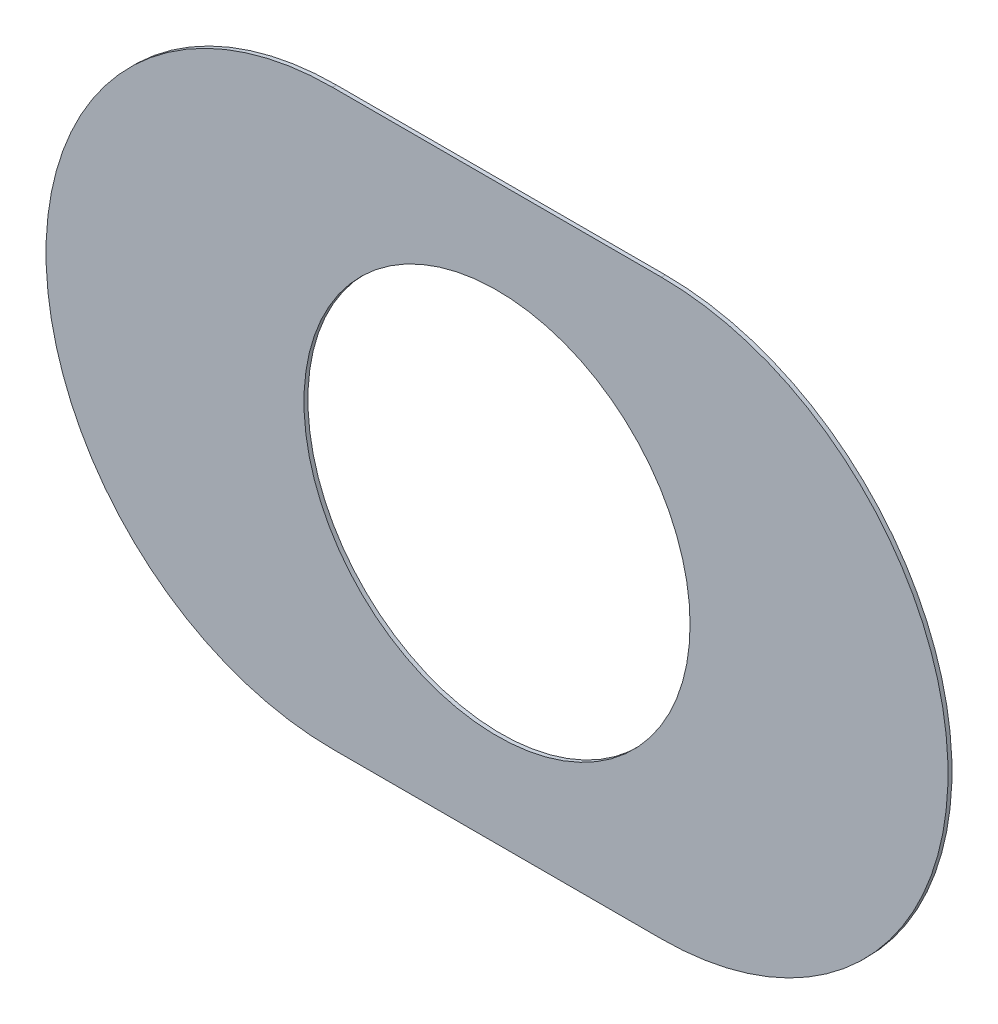
ISO-10303-21;
HEADER;
FILE_DESCRIPTION(('STEP AP214'),'2;1');
FILE_NAME('part.step','',(''),(''),'','','');
FILE_SCHEMA(('AUTOMOTIVE_DESIGN { 1 0 10303 214 1 1 1 1 }'));
ENDSEC;
DATA;
#1=APPLICATION_CONTEXT('core data for automotive mechanical design processes');
#2=APPLICATION_PROTOCOL_DEFINITION('international standard','automotive_design',2000,#1);
#3=PRODUCT_CONTEXT('',#1,'mechanical');
#4=PRODUCT('Part','Part','',(#3));
#5=PRODUCT_RELATED_PRODUCT_CATEGORY('part','',(#4));
#6=PRODUCT_DEFINITION_FORMATION('','',#4);
#7=PRODUCT_DEFINITION_CONTEXT('part definition',#1,'design');
#8=PRODUCT_DEFINITION('design','',#6,#7);
#9=PRODUCT_DEFINITION_SHAPE('','',#8);
#10=(LENGTH_UNIT() NAMED_UNIT(*) SI_UNIT(.MILLI.,.METRE.));
#11=(NAMED_UNIT(*) PLANE_ANGLE_UNIT() SI_UNIT($,.RADIAN.));
#12=(NAMED_UNIT(*) SI_UNIT($,.STERADIAN.) SOLID_ANGLE_UNIT());
#13=UNCERTAINTY_MEASURE_WITH_UNIT(LENGTH_MEASURE(1.E-05),#10,'distance_accuracy_value','');
#14=(GEOMETRIC_REPRESENTATION_CONTEXT(3) GLOBAL_UNCERTAINTY_ASSIGNED_CONTEXT((#13)) GLOBAL_UNIT_ASSIGNED_CONTEXT((#10,
#11,#12)) REPRESENTATION_CONTEXT('',''));
#15=CARTESIAN_POINT('',(0.,0.,0.));
#16=DIRECTION('',(0.,0.,1.));
#17=DIRECTION('',(1.,0.,0.));
#18=AXIS2_PLACEMENT_3D('',#15,#16,#17);
#19=CARTESIAN_POINT('',(24.3000003427268,32.3200006854535,0.));
#20=DIRECTION('',(0.,0.,1.));
#21=DIRECTION('',(1.,0.,0.));
#22=AXIS2_PLACEMENT_3D('',#19,#20,#21);
#23=PLANE('',#22);
#24=CARTESIAN_POINT('',(24.3000003427268,32.3200006854535,0.));
#25=DIRECTION('',(0.,0.,-1.));
#26=DIRECTION('',(-1.,0.,0.));
#27=AXIS2_PLACEMENT_3D('',#24,#25,#26);
#28=CIRCLE('',#27,0.49);
#29=CARTESIAN_POINT('',(24.7900003427268,32.3200006854535,0.));
#30=VERTEX_POINT('',#29);
#31=EDGE_CURVE('E79',#30,#30,#28,.T.);
#32=ORIENTED_EDGE('',*,*,#31,.T.);
#33=EDGE_LOOP('',(#32));
#34=FACE_BOUND('',#33,.T.);
#35=CARTESIAN_POINT('',(23.8825938881802,32.3200006854535,0.));
#36=DIRECTION('',(0.,0.,1.));
#37=DIRECTION('',(0.,1.,0.));
#38=AXIS2_PLACEMENT_3D('',#35,#36,#37);
#39=CIRCLE('',#38,0.727257121659981);
#40=CARTESIAN_POINT('',(23.8825938881802,33.0472578071135,0.));
#41=VERTEX_POINT('',#40);
#42=CARTESIAN_POINT('',(23.8825938881802,31.5927435637935,0.));
#43=VERTEX_POINT('',#42);
#44=EDGE_CURVE('E28',#41,#43,#39,.T.);
#45=ORIENTED_EDGE('',*,*,#44,.T.);
#46=DIRECTION('',(1.,0.,0.));
#47=VECTOR('',#46,1.);
#48=CARTESIAN_POINT('',(23.8825938881802,31.5927435637935,0.));
#49=LINE('',#48,#47);
#50=CARTESIAN_POINT('',(24.7174067972734,31.5927435637935,0.));
#51=VERTEX_POINT('',#50);
#52=EDGE_CURVE('E90',#43,#51,#49,.T.);
#53=ORIENTED_EDGE('',*,*,#52,.T.);
#54=CARTESIAN_POINT('',(24.7174067972734,32.3200006854535,0.));
#55=DIRECTION('',(0.,0.,1.));
#56=DIRECTION('',(0.,-1.,0.));
#57=AXIS2_PLACEMENT_3D('',#54,#55,#56);
#58=CIRCLE('',#57,0.727257121659981);
#59=CARTESIAN_POINT('',(24.7174067972734,33.0472578071135,0.));
#60=VERTEX_POINT('',#59);
#61=EDGE_CURVE('E67',#51,#60,#58,.T.);
#62=ORIENTED_EDGE('',*,*,#61,.T.);
#63=DIRECTION('',(-1.,0.,0.));
#64=VECTOR('',#63,1.);
#65=CARTESIAN_POINT('',(24.7174067972734,33.0472578071135,0.));
#66=LINE('',#65,#64);
#67=EDGE_CURVE('E21',#60,#41,#66,.T.);
#68=ORIENTED_EDGE('',*,*,#67,.T.);
#69=EDGE_LOOP('',(#45,#53,#62,#68));
#70=FACE_BOUND('',#69,.T.);
#71=ADVANCED_FACE('F17',(#34,#70),#23,.T.);
#72=CARTESIAN_POINT('',(24.3000003427268,32.3200006854535,-0.01));
#73=DIRECTION('',(0.,0.,1.));
#74=DIRECTION('',(1.,0.,0.));
#75=AXIS2_PLACEMENT_3D('',#72,#73,#74);
#76=PLANE('',#75);
#77=CARTESIAN_POINT('',(24.3000003427268,32.3200006854535,-0.01));
#78=DIRECTION('',(0.,0.,-1.));
#79=DIRECTION('',(-1.,0.,0.));
#80=AXIS2_PLACEMENT_3D('',#77,#78,#79);
#81=CIRCLE('',#80,0.49);
#82=CARTESIAN_POINT('',(24.7900003427268,32.3200006854535,-0.01));
#83=VERTEX_POINT('',#82);
#84=EDGE_CURVE('E138',#83,#83,#81,.T.);
#85=ORIENTED_EDGE('',*,*,#84,.F.);
#86=EDGE_LOOP('',(#85));
#87=FACE_BOUND('',#86,.T.);
#88=CARTESIAN_POINT('',(23.8825938881802,32.3200006854535,-0.01));
#89=DIRECTION('',(0.,0.,1.));
#90=DIRECTION('',(0.,1.,0.));
#91=AXIS2_PLACEMENT_3D('',#88,#89,#90);
#92=CIRCLE('',#91,0.727257121659981);
#93=CARTESIAN_POINT('',(23.8825938881802,33.0472578071135,-0.01));
#94=VERTEX_POINT('',#93);
#95=CARTESIAN_POINT('',(23.8825938881802,31.5927435637935,-0.01));
#96=VERTEX_POINT('',#95);
#97=EDGE_CURVE('E11',#94,#96,#92,.T.);
#98=ORIENTED_EDGE('',*,*,#97,.F.);
#99=DIRECTION('',(-1.,0.,0.));
#100=VECTOR('',#99,1.);
#101=CARTESIAN_POINT('',(24.7174067972734,33.0472578071135,-0.01));
#102=LINE('',#101,#100);
#103=CARTESIAN_POINT('',(24.7174067972734,33.0472578071135,-0.01));
#104=VERTEX_POINT('',#103);
#105=EDGE_CURVE('E96',#104,#94,#102,.T.);
#106=ORIENTED_EDGE('',*,*,#105,.F.);
#107=CARTESIAN_POINT('',(24.7174067972734,32.3200006854535,-0.01));
#108=DIRECTION('',(0.,0.,1.));
#109=DIRECTION('',(0.,-1.,0.));
#110=AXIS2_PLACEMENT_3D('',#107,#108,#109);
#111=CIRCLE('',#110,0.727257121659981);
#112=CARTESIAN_POINT('',(24.7174067972734,31.5927435637935,-0.01));
#113=VERTEX_POINT('',#112);
#114=EDGE_CURVE('E121',#113,#104,#111,.T.);
#115=ORIENTED_EDGE('',*,*,#114,.F.);
#116=DIRECTION('',(1.,0.,0.));
#117=VECTOR('',#116,1.);
#118=CARTESIAN_POINT('',(23.8825938881802,31.5927435637935,-0.01));
#119=LINE('',#118,#117);
#120=EDGE_CURVE('E85',#96,#113,#119,.T.);
#121=ORIENTED_EDGE('',*,*,#120,.F.);
#122=EDGE_LOOP('',(#98,#106,#115,#121));
#123=FACE_BOUND('',#122,.T.);
#124=ADVANCED_FACE('F94',(#87,#123),#76,.F.);
#125=CARTESIAN_POINT('',(23.8825938881802,32.3200006854535,0.));
#126=DIRECTION('',(0.,0.,1.));
#127=DIRECTION('',(0.,1.,0.));
#128=AXIS2_PLACEMENT_3D('',#125,#126,#127);
#129=CYLINDRICAL_SURFACE('',#128,0.727257121659981);
#130=ORIENTED_EDGE('',*,*,#44,.F.);
#131=DIRECTION('',(0.,0.,-1.));
#132=VECTOR('',#131,1.);
#133=CARTESIAN_POINT('',(23.8825938881802,33.0472578071135,0.));
#134=LINE('',#133,#132);
#135=EDGE_CURVE('E99',#41,#94,#134,.T.);
#136=ORIENTED_EDGE('',*,*,#135,.T.);
#137=ORIENTED_EDGE('',*,*,#97,.T.);
#138=DIRECTION('',(0.,0.,-1.));
#139=VECTOR('',#138,1.);
#140=CARTESIAN_POINT('',(23.8825938881802,31.5927435637935,0.));
#141=LINE('',#140,#139);
#142=EDGE_CURVE('E116',#43,#96,#141,.T.);
#143=ORIENTED_EDGE('',*,*,#142,.F.);
#144=EDGE_LOOP('',(#130,#136,#137,#143));
#145=FACE_BOUND('',#144,.T.);
#146=ADVANCED_FACE('F100',(#145),#129,.T.);
#147=CARTESIAN_POINT('',(23.8825938881802,31.5927435637935,0.));
#148=DIRECTION('',(0.,1.,0.));
#149=DIRECTION('',(1.,0.,0.));
#150=AXIS2_PLACEMENT_3D('',#147,#148,#149);
#151=PLANE('',#150);
#152=ORIENTED_EDGE('',*,*,#52,.F.);
#153=ORIENTED_EDGE('',*,*,#142,.T.);
#154=ORIENTED_EDGE('',*,*,#120,.T.);
#155=DIRECTION('',(0.,0.,-1.));
#156=VECTOR('',#155,1.);
#157=CARTESIAN_POINT('',(24.7174067972734,31.5927435637935,0.));
#158=LINE('',#157,#156);
#159=EDGE_CURVE('E118',#51,#113,#158,.T.);
#160=ORIENTED_EDGE('',*,*,#159,.F.);
#161=EDGE_LOOP('',(#152,#153,#154,#160));
#162=FACE_BOUND('',#161,.T.);
#163=ADVANCED_FACE('F147',(#162),#151,.F.);
#164=CARTESIAN_POINT('',(24.7174067972734,32.3200006854535,0.));
#165=DIRECTION('',(0.,0.,1.));
#166=DIRECTION('',(0.,-1.,0.));
#167=AXIS2_PLACEMENT_3D('',#164,#165,#166);
#168=CYLINDRICAL_SURFACE('',#167,0.727257121659981);
#169=ORIENTED_EDGE('',*,*,#61,.F.);
#170=ORIENTED_EDGE('',*,*,#159,.T.);
#171=ORIENTED_EDGE('',*,*,#114,.T.);
#172=DIRECTION('',(0.,0.,-1.));
#173=VECTOR('',#172,1.);
#174=CARTESIAN_POINT('',(24.7174067972734,33.0472578071135,0.));
#175=LINE('',#174,#173);
#176=EDGE_CURVE('E106',#60,#104,#175,.T.);
#177=ORIENTED_EDGE('',*,*,#176,.F.);
#178=EDGE_LOOP('',(#169,#170,#171,#177));
#179=FACE_BOUND('',#178,.T.);
#180=ADVANCED_FACE('F19',(#179),#168,.T.);
#181=CARTESIAN_POINT('',(24.7174067972734,33.0472578071135,0.));
#182=DIRECTION('',(0.,-1.,0.));
#183=DIRECTION('',(0.,0.,-1.));
#184=AXIS2_PLACEMENT_3D('',#181,#182,#183);
#185=PLANE('',#184);
#186=ORIENTED_EDGE('',*,*,#67,.F.);
#187=ORIENTED_EDGE('',*,*,#176,.T.);
#188=ORIENTED_EDGE('',*,*,#105,.T.);
#189=ORIENTED_EDGE('',*,*,#135,.F.);
#190=EDGE_LOOP('',(#186,#187,#188,#189));
#191=FACE_BOUND('',#190,.T.);
#192=ADVANCED_FACE('F105',(#191),#185,.F.);
#193=CARTESIAN_POINT('',(24.3000003427268,32.3200006854535,0.));
#194=DIRECTION('',(0.,0.,1.));
#195=DIRECTION('',(-1.,0.,0.));
#196=AXIS2_PLACEMENT_3D('',#193,#194,#195);
#197=CYLINDRICAL_SURFACE('',#196,0.49);
#198=ORIENTED_EDGE('',*,*,#84,.T.);
#199=DIRECTION('',(0.,0.,1.));
#200=VECTOR('',#199,1.);
#201=CARTESIAN_POINT('',(24.7900003427268,32.3200006854535,0.));
#202=LINE('',#201,#200);
#203=EDGE_CURVE('E134',#83,#30,#202,.T.);
#204=ORIENTED_EDGE('',*,*,#203,.T.);
#205=ORIENTED_EDGE('',*,*,#31,.F.);
#206=ORIENTED_EDGE('',*,*,#203,.F.);
#207=EDGE_LOOP('',(#198,#204,#205,#206));
#208=FACE_BOUND('',#207,.T.);
#209=ADVANCED_FACE('F154',(#208),#197,.F.);
#210=CLOSED_SHELL('',(#71,#124,#146,#163,#180,#192,#209));
#211=MANIFOLD_SOLID_BREP('B1',#210);
#212=ADVANCED_BREP_SHAPE_REPRESENTATION('',(#18,#211),#14);
#213=SHAPE_DEFINITION_REPRESENTATION(#9,#212);
ENDSEC;
END-ISO-10303-21;
